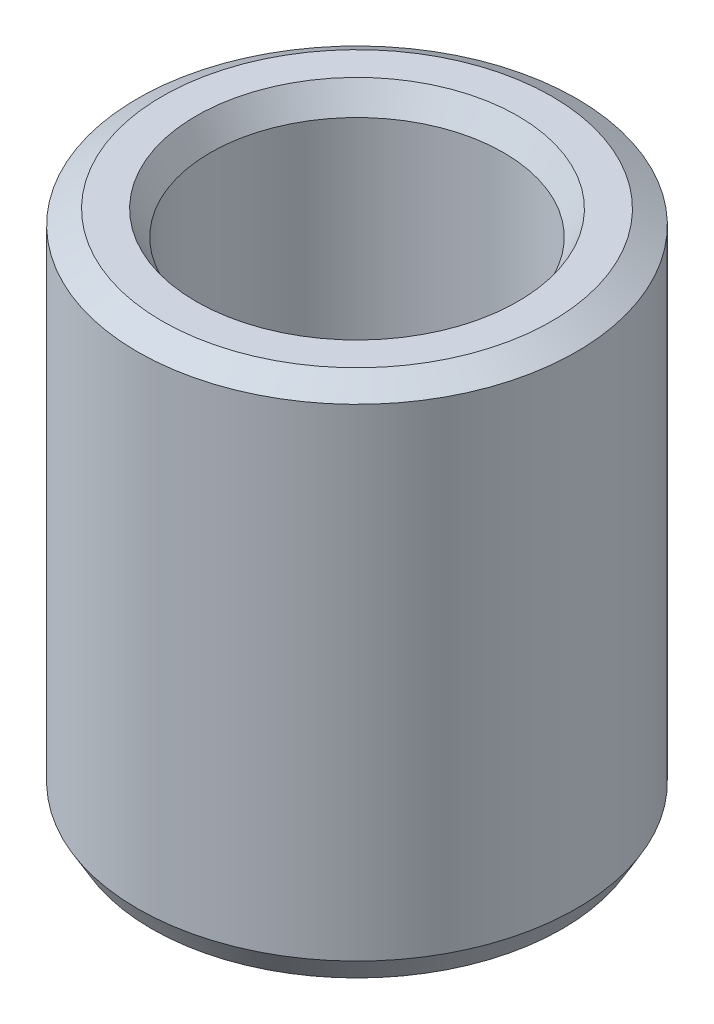
ISO-10303-21;
HEADER;
FILE_DESCRIPTION(('STEP AP214'),'2;1');
FILE_NAME('part.step','',(''),(''),'','','');
FILE_SCHEMA(('AUTOMOTIVE_DESIGN { 1 0 10303 214 1 1 1 1 }'));
ENDSEC;
DATA;
#1=APPLICATION_CONTEXT('core data for automotive mechanical design processes');
#2=APPLICATION_PROTOCOL_DEFINITION('international standard','automotive_design',2000,#1);
#3=PRODUCT_CONTEXT('',#1,'mechanical');
#4=PRODUCT('Part','Part','',(#3));
#5=PRODUCT_RELATED_PRODUCT_CATEGORY('part','',(#4));
#6=PRODUCT_DEFINITION_FORMATION('','',#4);
#7=PRODUCT_DEFINITION_CONTEXT('part definition',#1,'design');
#8=PRODUCT_DEFINITION('design','',#6,#7);
#9=PRODUCT_DEFINITION_SHAPE('','',#8);
#10=(LENGTH_UNIT() NAMED_UNIT(*) SI_UNIT(.MILLI.,.METRE.));
#11=(NAMED_UNIT(*) PLANE_ANGLE_UNIT() SI_UNIT($,.RADIAN.));
#12=(NAMED_UNIT(*) SI_UNIT($,.STERADIAN.) SOLID_ANGLE_UNIT());
#13=UNCERTAINTY_MEASURE_WITH_UNIT(LENGTH_MEASURE(1.E-05),#10,'distance_accuracy_value','');
#14=(GEOMETRIC_REPRESENTATION_CONTEXT(3) GLOBAL_UNCERTAINTY_ASSIGNED_CONTEXT((#13)) GLOBAL_UNIT_ASSIGNED_CONTEXT((#10,
#11,#12)) REPRESENTATION_CONTEXT('',''));
#15=CARTESIAN_POINT('',(0.,0.,0.));
#16=DIRECTION('',(0.,0.,1.));
#17=DIRECTION('',(1.,0.,0.));
#18=AXIS2_PLACEMENT_3D('',#15,#16,#17);
#19=CARTESIAN_POINT('',(0.,83.1030156425963,0.));
#20=DIRECTION('',(0.,-1.,0.));
#21=DIRECTION('',(0.,0.,-1.));
#22=AXIS2_PLACEMENT_3D('',#19,#20,#21);
#23=CYLINDRICAL_SURFACE('',#22,35.);
#24=CARTESIAN_POINT('',(0.,3.93390371304,0.));
#25=DIRECTION('',(0.,1.,0.));
#26=DIRECTION('',(0.,0.,1.));
#27=AXIS2_PLACEMENT_3D('',#24,#25,#26);
#28=CIRCLE('',#27,35.);
#29=CARTESIAN_POINT('',(0.,3.93390371303999,-35.));
#30=VERTEX_POINT('',#29);
#31=EDGE_CURVE('E10',#30,#30,#28,.T.);
#32=CARTESIAN_POINT('',(0.,80.8317752749067,0.));
#33=DIRECTION('',(0.,1.,0.));
#34=DIRECTION('',(0.,0.,1.));
#35=AXIS2_PLACEMENT_3D('',#32,#33,#34);
#36=CIRCLE('',#35,35.);
#37=CARTESIAN_POINT('',(0.,80.8317752749067,-35.));
#38=VERTEX_POINT('',#37);
#39=EDGE_CURVE('E50',#38,#38,#36,.F.);
#40=CARTESIAN_POINT('',(0.,3.93390371303999,-35.));
#41=CARTESIAN_POINT('',(0.,4.73492320847611,-35.));
#42=CARTESIAN_POINT('',(0.,5.53594270391222,-35.));
#43=CARTESIAN_POINT('',(0.,7.13798169478444,-35.));
#44=CARTESIAN_POINT('',(0.,7.93900119022055,-35.));
#45=CARTESIAN_POINT('',(0.,9.54104018109277,-35.));
#46=CARTESIAN_POINT('',(0.,10.3420596765289,-35.));
#47=CARTESIAN_POINT('',(0.,11.9440986674011,-35.));
#48=CARTESIAN_POINT('',(0.,12.7451181628372,-35.));
#49=CARTESIAN_POINT('',(0.,14.3471571537094,-35.));
#50=CARTESIAN_POINT('',(0.,15.1481766491456,-35.));
#51=CARTESIAN_POINT('',(0.,16.7502156400178,-35.));
#52=CARTESIAN_POINT('',(0.,17.5512351354539,-35.));
#53=CARTESIAN_POINT('',(0.,19.1532741263261,-35.));
#54=CARTESIAN_POINT('',(0.,19.9542936217622,-35.));
#55=CARTESIAN_POINT('',(0.,21.5563326126344,-35.));
#56=CARTESIAN_POINT('',(0.,22.3573521080705,-35.));
#57=CARTESIAN_POINT('',(0.,23.9593910989428,-35.));
#58=CARTESIAN_POINT('',(0.,24.7604105943789,-35.));
#59=CARTESIAN_POINT('',(0.,26.3624495852511,-35.));
#60=CARTESIAN_POINT('',(0.,27.1634690806872,-35.));
#61=CARTESIAN_POINT('',(0.,28.7655080715594,-35.));
#62=CARTESIAN_POINT('',(0.,29.5665275669955,-35.));
#63=CARTESIAN_POINT('',(0.,31.1685665578678,-35.));
#64=CARTESIAN_POINT('',(0.,31.9695860533039,-35.));
#65=CARTESIAN_POINT('',(0.,33.5716250441761,-35.));
#66=CARTESIAN_POINT('',(0.,34.3726445396122,-35.));
#67=CARTESIAN_POINT('',(0.,35.9746835304844,-35.));
#68=CARTESIAN_POINT('',(0.,36.7757030259205,-35.));
#69=CARTESIAN_POINT('',(0.,38.3777420167928,-35.));
#70=CARTESIAN_POINT('',(0.,39.1787615122289,-35.));
#71=CARTESIAN_POINT('',(0.,40.7808005031011,-35.));
#72=CARTESIAN_POINT('',(0.,41.5818199985372,-35.));
#73=CARTESIAN_POINT('',(0.,43.1838589894094,-35.));
#74=CARTESIAN_POINT('',(0.,43.9848784848456,-35.));
#75=CARTESIAN_POINT('',(0.,45.5869174757178,-35.));
#76=CARTESIAN_POINT('',(0.,46.3879369711539,-35.));
#77=CARTESIAN_POINT('',(0.,47.9899759620261,-35.));
#78=CARTESIAN_POINT('',(0.,48.7909954574622,-35.));
#79=CARTESIAN_POINT('',(0.,50.3930344483344,-35.));
#80=CARTESIAN_POINT('',(0.,51.1940539437705,-35.));
#81=CARTESIAN_POINT('',(0.,52.7960929346428,-35.));
#82=CARTESIAN_POINT('',(0.,53.5971124300789,-35.));
#83=CARTESIAN_POINT('',(0.,55.1991514209511,-35.));
#84=CARTESIAN_POINT('',(0.,56.0001709163872,-35.));
#85=CARTESIAN_POINT('',(0.,57.6022099072595,-35.));
#86=CARTESIAN_POINT('',(0.,58.4032294026956,-35.));
#87=CARTESIAN_POINT('',(0.,60.0052683935678,-35.));
#88=CARTESIAN_POINT('',(0.,60.8062878890039,-35.));
#89=CARTESIAN_POINT('',(0.,62.4083268798761,-35.));
#90=CARTESIAN_POINT('',(0.,63.2093463753122,-35.));
#91=CARTESIAN_POINT('',(0.,64.8113853661844,-35.));
#92=CARTESIAN_POINT('',(0.,65.6124048616206,-35.));
#93=CARTESIAN_POINT('',(0.,67.2144438524928,-35.));
#94=CARTESIAN_POINT('',(0.,68.0154633479289,-35.));
#95=CARTESIAN_POINT('',(0.,69.6175023388011,-35.));
#96=CARTESIAN_POINT('',(0.,70.4185218342372,-35.));
#97=CARTESIAN_POINT('',(0.,72.0205608251095,-35.));
#98=CARTESIAN_POINT('',(0.,72.8215803205456,-35.));
#99=CARTESIAN_POINT('',(0.,74.4236193114178,-35.));
#100=CARTESIAN_POINT('',(0.,75.2246388068539,-35.));
#101=CARTESIAN_POINT('',(0.,76.8266777977261,-35.));
#102=CARTESIAN_POINT('',(0.,77.6276972931622,-35.));
#103=CARTESIAN_POINT('',(0.,79.2297362840344,-35.));
#104=CARTESIAN_POINT('',(0.,80.0307557794706,-35.));
#105=CARTESIAN_POINT('',(0.,80.8317752749067,-35.));
#106=B_SPLINE_CURVE_WITH_KNOTS('',3,(#40,#41,#42,#43,#44,#45,#46,#47,#48,#49,#50,#51,#52,#53,
#54,#55,#56,#57,#58,#59,#60,#61,#62,#63,#64,#65,#66,#67,#68,#69,#70,#71,#72,#73,#74,#75,#76,#77,
#78,#79,#80,#81,#82,#83,#84,#85,#86,#87,#88,#89,#90,#91,#92,#93,#94,#95,#96,#97,#98,#99,#100,
#101,#102,#103,#104,#105),.UNSPECIFIED.,.F.,.F.,(4,2,2,2,2,2,2,2,2,2,2,2,2,2,2,2,2,2,2,2,2,2,2,
2,2,2,2,2,2,2,2,2,4),(0.,2.40305848630834,4.80611697261667,7.20917545892501,9.61223394523333,
12.0152924315417,14.41835091785,16.8214094041583,19.2244678904667,21.627526376775,
24.0305848630833,26.4336433493917,28.8367018357,31.2397603220083,33.6428188083167,
36.045877294625,38.4489357809333,40.8519942672417,43.25505275355,45.6581112398583,
48.0611697261667,50.464228212475,52.8672866987834,55.2703451850917,57.6734036714,
60.0764621577083,62.4795206440167,64.882579130325,67.2856376166334,69.6886961029417,
72.09175458925,74.4948130755583,76.8978715618667),.UNSPECIFIED.);
#107=EDGE_CURVE('BSEAM39',#30,#38,#106,.T.);
#108=ORIENTED_EDGE('',*,*,#31,.T.);
#109=ORIENTED_EDGE('',*,*,#39,.T.);
#110=ORIENTED_EDGE('',*,*,#107,.T.);
#111=ORIENTED_EDGE('',*,*,#107,.F.);
#112=EDGE_LOOP('',(#108,#110,#109,#111));
#113=FACE_BOUND('',#112,.T.);
#114=ADVANCED_FACE('F39',(#113),#23,.T.);
#115=CARTESIAN_POINT('',(0.,83.1030156425963,0.));
#116=DIRECTION('',(0.,1.,0.));
#117=DIRECTION('',(0.,0.,1.));
#118=AXIS2_PLACEMENT_3D('',#115,#116,#117);
#119=PLANE('',#118);
#120=CARTESIAN_POINT('',(0.,83.1030156425963,0.));
#121=DIRECTION('',(0.,1.,0.));
#122=DIRECTION('',(0.,0.,1.));
#123=AXIS2_PLACEMENT_3D('',#120,#121,#122);
#124=CIRCLE('',#123,25.648938433193);
#125=CARTESIAN_POINT('',(0.,83.1030156425963,25.648938433193));
#126=VERTEX_POINT('',#125);
#127=EDGE_CURVE('E58',#126,#126,#124,.F.);
#128=ORIENTED_EDGE('',*,*,#127,.T.);
#129=EDGE_LOOP('',(#128));
#130=FACE_BOUND('',#129,.T.);
#131=CARTESIAN_POINT('',(0.,83.1030156425963,0.));
#132=DIRECTION('',(0.,1.,0.));
#133=DIRECTION('',(0.,0.,1.));
#134=AXIS2_PLACEMENT_3D('',#131,#132,#133);
#135=CIRCLE('',#134,31.0660962869602);
#136=CARTESIAN_POINT('',(0.,83.1030156425963,31.0660962869602));
#137=VERTEX_POINT('',#136);
#138=EDGE_CURVE('E61',#137,#137,#135,.T.);
#139=ORIENTED_EDGE('',*,*,#138,.T.);
#140=EDGE_LOOP('',(#139));
#141=FACE_BOUND('',#140,.T.);
#142=ADVANCED_FACE('F88',(#130,#141),#119,.T.);
#143=CARTESIAN_POINT('',(0.,0.,0.));
#144=DIRECTION('',(0.,1.,0.));
#145=DIRECTION('',(0.,0.,1.));
#146=AXIS2_PLACEMENT_3D('',#143,#144,#145);
#147=PLANE('',#146);
#148=CARTESIAN_POINT('',(0.,0.,0.));
#149=DIRECTION('',(0.,1.,0.));
#150=DIRECTION('',(0.,0.,1.));
#151=AXIS2_PLACEMENT_3D('',#148,#149,#150);
#152=CIRCLE('',#151,27.3116017785431);
#153=CARTESIAN_POINT('',(0.,0.,27.3116017785431));
#154=VERTEX_POINT('',#153);
#155=EDGE_CURVE('E51',#154,#154,#152,.T.);
#156=ORIENTED_EDGE('',*,*,#155,.T.);
#157=EDGE_LOOP('',(#156));
#158=FACE_BOUND('',#157,.T.);
#159=CARTESIAN_POINT('',(0.,0.,0.));
#160=DIRECTION('',(0.,1.,0.));
#161=DIRECTION('',(0.,0.,1.));
#162=AXIS2_PLACEMENT_3D('',#159,#160,#161);
#163=CIRCLE('',#162,32.7287596323103);
#164=CARTESIAN_POINT('',(0.,0.,32.7287596323103));
#165=VERTEX_POINT('',#164);
#166=EDGE_CURVE('E54',#165,#165,#163,.F.);
#167=ORIENTED_EDGE('',*,*,#166,.T.);
#168=EDGE_LOOP('',(#167));
#169=FACE_BOUND('',#168,.T.);
#170=ADVANCED_FACE('F83',(#158,#169),#147,.F.);
#171=CARTESIAN_POINT('',(0.,83.1030156425963,0.));
#172=DIRECTION('',(0.,-1.,0.));
#173=DIRECTION('',(0.,0.,-1.));
#174=AXIS2_PLACEMENT_3D('',#171,#172,#173);
#175=CYLINDRICAL_SURFACE('',#174,23.3776980655032);
#176=CARTESIAN_POINT('',(0.,79.1691119295563,0.));
#177=DIRECTION('',(0.,1.,0.));
#178=DIRECTION('',(0.,0.,1.));
#179=AXIS2_PLACEMENT_3D('',#176,#177,#178);
#180=CIRCLE('',#179,23.3776980655032);
#181=CARTESIAN_POINT('',(0.,79.1691119295563,-23.3776980655032));
#182=VERTEX_POINT('',#181);
#183=EDGE_CURVE('E67',#182,#182,#180,.T.);
#184=CARTESIAN_POINT('',(0.,2.27124036768962,0.));
#185=DIRECTION('',(0.,1.,0.));
#186=DIRECTION('',(0.,0.,1.));
#187=AXIS2_PLACEMENT_3D('',#184,#185,#186);
#188=CIRCLE('',#187,23.3776980655032);
#189=CARTESIAN_POINT('',(0.,2.27124036768962,-23.3776980655032));
#190=VERTEX_POINT('',#189);
#191=EDGE_CURVE('E69',#190,#190,#188,.F.);
#192=CARTESIAN_POINT('',(0.,79.1691119295563,-23.3776980655032));
#193=CARTESIAN_POINT('',(0.,78.3680924341202,-23.3776980655032));
#194=CARTESIAN_POINT('',(0.,77.5670729386841,-23.3776980655032));
#195=CARTESIAN_POINT('',(0.,75.9650339478119,-23.3776980655032));
#196=CARTESIAN_POINT('',(0.,75.1640144523758,-23.3776980655032));
#197=CARTESIAN_POINT('',(0.,73.5619754615036,-23.3776980655032));
#198=CARTESIAN_POINT('',(0.,72.7609559660674,-23.3776980655032));
#199=CARTESIAN_POINT('',(0.,71.1589169751952,-23.3776980655032));
#200=CARTESIAN_POINT('',(0.,70.3578974797591,-23.3776980655032));
#201=CARTESIAN_POINT('',(0.,68.7558584888869,-23.3776980655032));
#202=CARTESIAN_POINT('',(0.,67.9548389934508,-23.3776980655032));
#203=CARTESIAN_POINT('',(0.,66.3528000025785,-23.3776980655032));
#204=CARTESIAN_POINT('',(0.,65.5517805071424,-23.3776980655032));
#205=CARTESIAN_POINT('',(0.,63.9497415162702,-23.3776980655032));
#206=CARTESIAN_POINT('',(0.,63.1487220208341,-23.3776980655032));
#207=CARTESIAN_POINT('',(0.,61.5466830299619,-23.3776980655032));
#208=CARTESIAN_POINT('',(0.,60.7456635345258,-23.3776980655032));
#209=CARTESIAN_POINT('',(0.,59.1436245436535,-23.3776980655032));
#210=CARTESIAN_POINT('',(0.,58.3426050482174,-23.3776980655032));
#211=CARTESIAN_POINT('',(0.,56.7405660573452,-23.3776980655032));
#212=CARTESIAN_POINT('',(0.,55.9395465619091,-23.3776980655032));
#213=CARTESIAN_POINT('',(0.,54.3375075710369,-23.3776980655032));
#214=CARTESIAN_POINT('',(0.,53.5364880756008,-23.3776980655032));
#215=CARTESIAN_POINT('',(0.,51.9344490847285,-23.3776980655032));
#216=CARTESIAN_POINT('',(0.,51.1334295892924,-23.3776980655032));
#217=CARTESIAN_POINT('',(0.,49.5313905984202,-23.3776980655032));
#218=CARTESIAN_POINT('',(0.,48.7303711029841,-23.3776980655032));
#219=CARTESIAN_POINT('',(0.,47.1283321121119,-23.3776980655032));
#220=CARTESIAN_POINT('',(0.,46.3273126166758,-23.3776980655032));
#221=CARTESIAN_POINT('',(0.,44.7252736258035,-23.3776980655032));
#222=CARTESIAN_POINT('',(0.,43.9242541303674,-23.3776980655032));
#223=CARTESIAN_POINT('',(0.,42.3222151394952,-23.3776980655032));
#224=CARTESIAN_POINT('',(0.,41.5211956440591,-23.3776980655032));
#225=CARTESIAN_POINT('',(0.,39.9191566531869,-23.3776980655032));
#226=CARTESIAN_POINT('',(0.,39.1181371577508,-23.3776980655032));
#227=CARTESIAN_POINT('',(0.,37.5160981668785,-23.3776980655032));
#228=CARTESIAN_POINT('',(0.,36.7150786714424,-23.3776980655032));
#229=CARTESIAN_POINT('',(0.,35.1130396805702,-23.3776980655032));
#230=CARTESIAN_POINT('',(0.,34.3120201851341,-23.3776980655032));
#231=CARTESIAN_POINT('',(0.,32.7099811942619,-23.3776980655032));
#232=CARTESIAN_POINT('',(0.,31.9089616988257,-23.3776980655032));
#233=CARTESIAN_POINT('',(0.,30.3069227079535,-23.3776980655032));
#234=CARTESIAN_POINT('',(0.,29.5059032125174,-23.3776980655032));
#235=CARTESIAN_POINT('',(0.,27.9038642216452,-23.3776980655032));
#236=CARTESIAN_POINT('',(0.,27.1028447262091,-23.3776980655032));
#237=CARTESIAN_POINT('',(0.,25.5008057353369,-23.3776980655032));
#238=CARTESIAN_POINT('',(0.,24.6997862399007,-23.3776980655032));
#239=CARTESIAN_POINT('',(0.,23.0977472490285,-23.3776980655032));
#240=CARTESIAN_POINT('',(0.,22.2967277535924,-23.3776980655032));
#241=CARTESIAN_POINT('',(0.,20.6946887627202,-23.3776980655032));
#242=CARTESIAN_POINT('',(0.,19.8936692672841,-23.3776980655032));
#243=CARTESIAN_POINT('',(0.,18.2916302764119,-23.3776980655032));
#244=CARTESIAN_POINT('',(0.,17.4906107809757,-23.3776980655032));
#245=CARTESIAN_POINT('',(0.,15.8885717901035,-23.3776980655032));
#246=CARTESIAN_POINT('',(0.,15.0875522946674,-23.3776980655032));
#247=CARTESIAN_POINT('',(0.,13.4855133037952,-23.3776980655032));
#248=CARTESIAN_POINT('',(0.,12.6844938083591,-23.3776980655032));
#249=CARTESIAN_POINT('',(0.,11.0824548174868,-23.3776980655032));
#250=CARTESIAN_POINT('',(0.,10.2814353220507,-23.3776980655032));
#251=CARTESIAN_POINT('',(0.,8.67939633117852,-23.3776980655032));
#252=CARTESIAN_POINT('',(0.,7.8783768357424,-23.3776980655032));
#253=CARTESIAN_POINT('',(0.,6.27633784487018,-23.3776980655032));
#254=CARTESIAN_POINT('',(0.,5.47531834943407,-23.3776980655032));
#255=CARTESIAN_POINT('',(0.,3.87327935856185,-23.3776980655032));
#256=CARTESIAN_POINT('',(0.,3.07225986312574,-23.3776980655032));
#257=CARTESIAN_POINT('',(0.,2.27124036768962,-23.3776980655032));
#258=B_SPLINE_CURVE_WITH_KNOTS('',3,(#192,#193,#194,#195,#196,#197,#198,#199,#200,#201,#202,
#203,#204,#205,#206,#207,#208,#209,#210,#211,#212,#213,#214,#215,#216,#217,#218,#219,#220,#221,
#222,#223,#224,#225,#226,#227,#228,#229,#230,#231,#232,#233,#234,#235,#236,#237,#238,#239,#240,
#241,#242,#243,#244,#245,#246,#247,#248,#249,#250,#251,#252,#253,#254,#255,#256,#257),
.UNSPECIFIED.,.F.,.F.,(4,2,2,2,2,2,2,2,2,2,2,2,2,2,2,2,2,2,2,2,2,2,2,2,2,2,2,2,2,2,2,2,4),(0.,
2.40305848630833,4.80611697261667,7.20917545892499,9.61223394523333,12.0152924315417,
14.41835091785,16.8214094041583,19.2244678904667,21.627526376775,24.0305848630833,
26.4336433493917,28.8367018357,31.2397603220083,33.6428188083167,36.045877294625,
38.4489357809333,40.8519942672417,43.25505275355,45.6581112398583,48.0611697261667,
50.464228212475,52.8672866987834,55.2703451850917,57.6734036714,60.0764621577084,
62.4795206440167,64.882579130325,67.2856376166334,69.6886961029417,72.09175458925,
74.4948130755584,76.8978715618667),.UNSPECIFIED.);
#259=EDGE_CURVE('BSEAM71',#182,#190,#258,.T.);
#260=ORIENTED_EDGE('',*,*,#183,.T.);
#261=ORIENTED_EDGE('',*,*,#191,.T.);
#262=ORIENTED_EDGE('',*,*,#259,.T.);
#263=ORIENTED_EDGE('',*,*,#259,.F.);
#264=EDGE_LOOP('',(#260,#262,#261,#263));
#265=FACE_BOUND('',#264,.T.);
#266=ADVANCED_FACE('F71',(#265),#175,.F.);
#267=CARTESIAN_POINT('',(0.,79.1691119295563,0.));
#268=DIRECTION('',(0.,1.,0.));
#269=DIRECTION('',(0.,0.,1.));
#270=AXIS2_PLACEMENT_3D('',#267,#268,#269);
#271=CONICAL_SURFACE('',#270,23.3776980655032,0.523598775598304);
#272=ORIENTED_EDGE('',*,*,#127,.F.);
#273=EDGE_LOOP('',(#272));
#274=FACE_BOUND('',#273,.T.);
#275=ORIENTED_EDGE('',*,*,#183,.F.);
#276=EDGE_LOOP('',(#275));
#277=FACE_BOUND('',#276,.T.);
#278=ADVANCED_FACE('F77',(#274,#277),#271,.F.);
#279=CARTESIAN_POINT('',(0.,0.,0.));
#280=DIRECTION('',(0.,-1.,0.));
#281=DIRECTION('',(0.,0.,-1.));
#282=AXIS2_PLACEMENT_3D('',#279,#280,#281);
#283=CONICAL_SURFACE('',#282,27.3116017785431,1.04719755119659);
#284=ORIENTED_EDGE('',*,*,#191,.F.);
#285=EDGE_LOOP('',(#284));
#286=FACE_BOUND('',#285,.T.);
#287=ORIENTED_EDGE('',*,*,#155,.F.);
#288=EDGE_LOOP('',(#287));
#289=FACE_BOUND('',#288,.T.);
#290=ADVANCED_FACE('F73',(#286,#289),#283,.F.);
#291=CARTESIAN_POINT('',(0.,3.93390371304,0.));
#292=DIRECTION('',(0.,1.,0.));
#293=DIRECTION('',(0.,0.,1.));
#294=AXIS2_PLACEMENT_3D('',#291,#292,#293);
#295=CONICAL_SURFACE('',#294,35.,0.523598775598302);
#296=ORIENTED_EDGE('',*,*,#166,.F.);
#297=EDGE_LOOP('',(#296));
#298=FACE_BOUND('',#297,.T.);
#299=ORIENTED_EDGE('',*,*,#31,.F.);
#300=EDGE_LOOP('',(#299));
#301=FACE_BOUND('',#300,.T.);
#302=ADVANCED_FACE('F76',(#298,#301),#295,.T.);
#303=CARTESIAN_POINT('',(0.,83.1030156425963,0.));
#304=DIRECTION('',(0.,-1.,0.));
#305=DIRECTION('',(0.,0.,-1.));
#306=AXIS2_PLACEMENT_3D('',#303,#304,#305);
#307=CONICAL_SURFACE('',#306,31.0660962869602,1.04719755119659);
#308=ORIENTED_EDGE('',*,*,#39,.F.);
#309=EDGE_LOOP('',(#308));
#310=FACE_BOUND('',#309,.T.);
#311=ORIENTED_EDGE('',*,*,#138,.F.);
#312=EDGE_LOOP('',(#311));
#313=FACE_BOUND('',#312,.T.);
#314=ADVANCED_FACE('F45',(#310,#313),#307,.T.);
#315=CLOSED_SHELL('',(#114,#142,#170,#266,#278,#290,#302,#314));
#316=MANIFOLD_SOLID_BREP('B2',#315);
#317=ADVANCED_BREP_SHAPE_REPRESENTATION('',(#18,#316),#14);
#318=SHAPE_DEFINITION_REPRESENTATION(#9,#317);
ENDSEC;
END-ISO-10303-21;
